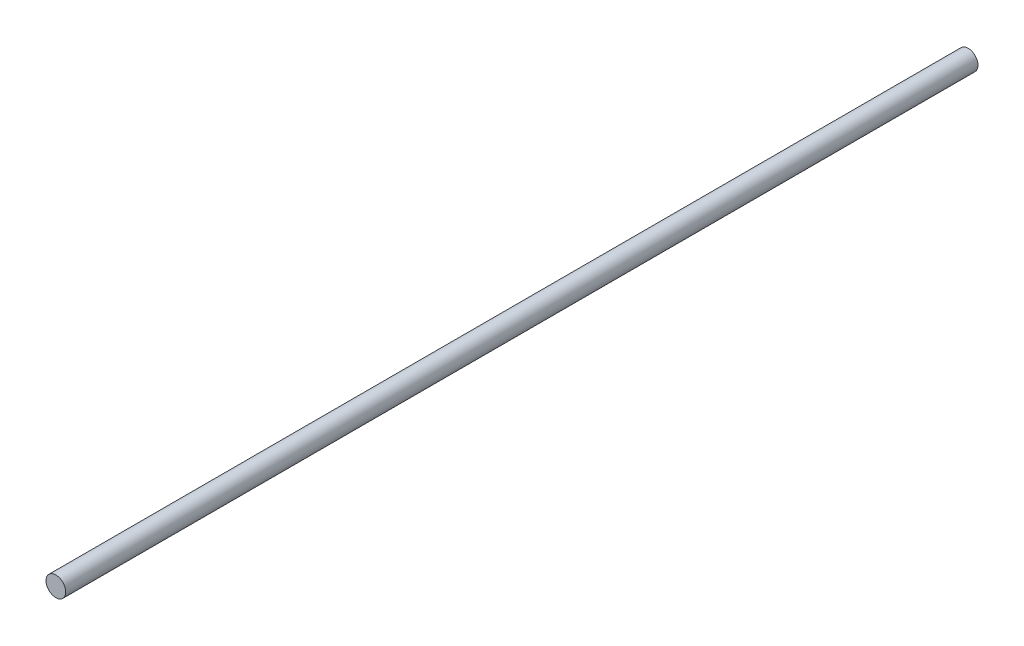
ISO-10303-21;
HEADER;
FILE_DESCRIPTION(('STEP AP214'),'2;1');
FILE_NAME('part.step','',(''),(''),'','','');
FILE_SCHEMA(('AUTOMOTIVE_DESIGN { 1 0 10303 214 1 1 1 1 }'));
ENDSEC;
DATA;
#1=APPLICATION_CONTEXT('core data for automotive mechanical design processes');
#2=APPLICATION_PROTOCOL_DEFINITION('international standard','automotive_design',2000,#1);
#3=PRODUCT_CONTEXT('',#1,'mechanical');
#4=PRODUCT('Part','Part','',(#3));
#5=PRODUCT_RELATED_PRODUCT_CATEGORY('part','',(#4));
#6=PRODUCT_DEFINITION_FORMATION('','',#4);
#7=PRODUCT_DEFINITION_CONTEXT('part definition',#1,'design');
#8=PRODUCT_DEFINITION('design','',#6,#7);
#9=PRODUCT_DEFINITION_SHAPE('','',#8);
#10=(LENGTH_UNIT() NAMED_UNIT(*) SI_UNIT(.MILLI.,.METRE.));
#11=(NAMED_UNIT(*) PLANE_ANGLE_UNIT() SI_UNIT($,.RADIAN.));
#12=(NAMED_UNIT(*) SI_UNIT($,.STERADIAN.) SOLID_ANGLE_UNIT());
#13=UNCERTAINTY_MEASURE_WITH_UNIT(LENGTH_MEASURE(1.E-05),#10,'distance_accuracy_value','');
#14=(GEOMETRIC_REPRESENTATION_CONTEXT(3) GLOBAL_UNCERTAINTY_ASSIGNED_CONTEXT((#13)) GLOBAL_UNIT_ASSIGNED_CONTEXT((#10,
#11,#12)) REPRESENTATION_CONTEXT('',''));
#15=CARTESIAN_POINT('',(0.,0.,0.));
#16=DIRECTION('',(0.,0.,1.));
#17=DIRECTION('',(1.,0.,0.));
#18=AXIS2_PLACEMENT_3D('',#15,#16,#17);
#19=CARTESIAN_POINT('',(0.,0.,185.));
#20=DIRECTION('',(0.,0.,-1.));
#21=DIRECTION('',(-1.,0.,0.));
#22=AXIS2_PLACEMENT_3D('',#19,#20,#21);
#23=CYLINDRICAL_SURFACE('',#22,4.);
#24=CARTESIAN_POINT('',(0.,0.,185.));
#25=DIRECTION('',(0.,0.,1.));
#26=DIRECTION('',(1.,0.,0.));
#27=AXIS2_PLACEMENT_3D('',#24,#25,#26);
#28=CIRCLE('',#27,4.);
#29=CARTESIAN_POINT('',(4.,0.,185.));
#30=VERTEX_POINT('',#29);
#31=EDGE_CURVE('E9',#30,#30,#28,.T.);
#32=ORIENTED_EDGE('',*,*,#31,.F.);
#33=EDGE_LOOP('',(#32));
#34=FACE_BOUND('',#33,.T.);
#35=CARTESIAN_POINT('',(0.,0.,-185.));
#36=DIRECTION('',(0.,0.,1.));
#37=DIRECTION('',(1.,0.,0.));
#38=AXIS2_PLACEMENT_3D('',#35,#36,#37);
#39=CIRCLE('',#38,4.);
#40=CARTESIAN_POINT('',(4.,0.,-185.));
#41=VERTEX_POINT('',#40);
#42=EDGE_CURVE('E17',#41,#41,#39,.T.);
#43=ORIENTED_EDGE('',*,*,#42,.T.);
#44=EDGE_LOOP('',(#43));
#45=FACE_BOUND('',#44,.T.);
#46=ADVANCED_FACE('F14',(#34,#45),#23,.T.);
#47=CARTESIAN_POINT('',(0.,0.,185.));
#48=DIRECTION('',(0.,0.,1.));
#49=DIRECTION('',(1.,0.,0.));
#50=AXIS2_PLACEMENT_3D('',#47,#48,#49);
#51=PLANE('',#50);
#52=ORIENTED_EDGE('',*,*,#31,.T.);
#53=EDGE_LOOP('',(#52));
#54=FACE_BOUND('',#53,.T.);
#55=ADVANCED_FACE('F29',(#54),#51,.T.);
#56=CARTESIAN_POINT('',(0.,0.,-185.));
#57=DIRECTION('',(0.,0.,1.));
#58=DIRECTION('',(1.,0.,0.));
#59=AXIS2_PLACEMENT_3D('',#56,#57,#58);
#60=PLANE('',#59);
#61=ORIENTED_EDGE('',*,*,#42,.F.);
#62=EDGE_LOOP('',(#61));
#63=FACE_BOUND('',#62,.T.);
#64=ADVANCED_FACE('F27',(#63),#60,.F.);
#65=CLOSED_SHELL('',(#46,#55,#64));
#66=MANIFOLD_SOLID_BREP('B1',#65);
#67=ADVANCED_BREP_SHAPE_REPRESENTATION('',(#18,#66),#14);
#68=SHAPE_DEFINITION_REPRESENTATION(#9,#67);
ENDSEC;
END-ISO-10303-21;
